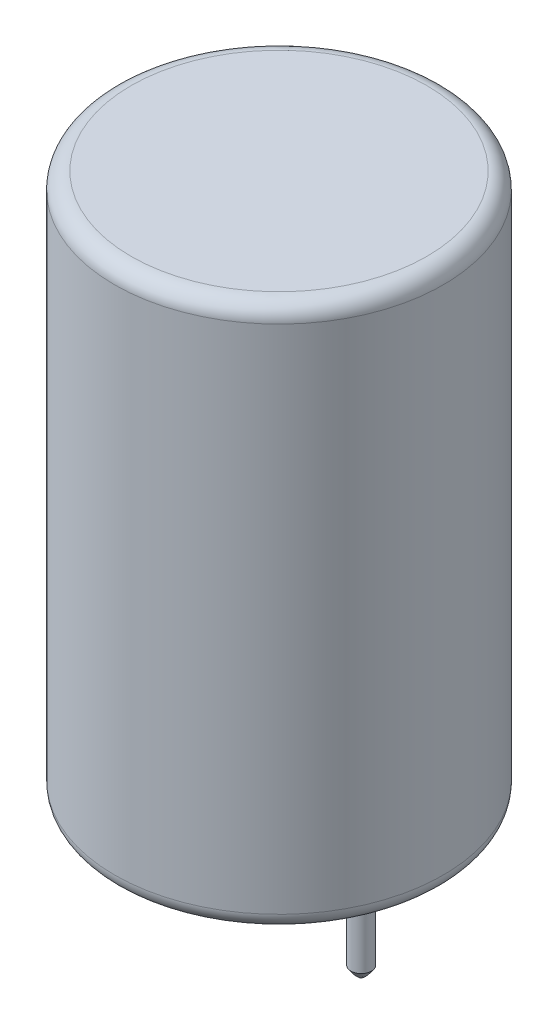
ISO-10303-21;
HEADER;
FILE_DESCRIPTION(('STEP AP214'),'2;1');
FILE_NAME('part.step','',(''),(''),'','','');
FILE_SCHEMA(('AUTOMOTIVE_DESIGN { 1 0 10303 214 1 1 1 1 }'));
ENDSEC;
DATA;
#1=APPLICATION_CONTEXT('core data for automotive mechanical design processes');
#2=APPLICATION_PROTOCOL_DEFINITION('international standard','automotive_design',2000,#1);
#3=PRODUCT_CONTEXT('',#1,'mechanical');
#4=PRODUCT('Part','Part','',(#3));
#5=PRODUCT_RELATED_PRODUCT_CATEGORY('part','',(#4));
#6=PRODUCT_DEFINITION_FORMATION('','',#4);
#7=PRODUCT_DEFINITION_CONTEXT('part definition',#1,'design');
#8=PRODUCT_DEFINITION('design','',#6,#7);
#9=PRODUCT_DEFINITION_SHAPE('','',#8);
#10=(LENGTH_UNIT() NAMED_UNIT(*) SI_UNIT(.MILLI.,.METRE.));
#11=(NAMED_UNIT(*) PLANE_ANGLE_UNIT() SI_UNIT($,.RADIAN.));
#12=(NAMED_UNIT(*) SI_UNIT($,.STERADIAN.) SOLID_ANGLE_UNIT());
#13=UNCERTAINTY_MEASURE_WITH_UNIT(LENGTH_MEASURE(1.E-05),#10,'distance_accuracy_value','');
#14=(GEOMETRIC_REPRESENTATION_CONTEXT(3) GLOBAL_UNCERTAINTY_ASSIGNED_CONTEXT((#13)) GLOBAL_UNIT_ASSIGNED_CONTEXT((#10,
#11,#12)) REPRESENTATION_CONTEXT('',''));
#15=CARTESIAN_POINT('',(0.,0.,0.));
#16=DIRECTION('',(0.,0.,1.));
#17=DIRECTION('',(1.,0.,0.));
#18=AXIS2_PLACEMENT_3D('',#15,#16,#17);
#19=CARTESIAN_POINT('',(-2.2121405764895,-2.97991995029477,-0.33841980886002));
#20=CARTESIAN_POINT('',(-2.2121405764895,-3.02540346747887,-0.284272771610083));
#21=CARTESIAN_POINT('',(-2.2121405764895,-3.06685307894785,-0.230125734360147));
#22=CARTESIAN_POINT('',(-2.2121405764895,-3.10557640983094,-0.175978697110203));
#23=CARTESIAN_POINT('',(-2.2121405764895,-3.1500061513419,-0.0947580309862556));
#24=CARTESIAN_POINT('',(-2.2121405764895,-3.1622970764374,-0.013537364862308));
#25=CARTESIAN_POINT('',(-2.2121405764895,-3.16229714390734,0.0135362640117029));
#26=CARTESIAN_POINT('',(-2.2121405764895,-3.15000657529725,0.0947571506337286));
#27=CARTESIAN_POINT('',(-2.2121405764895,-3.10557691698548,0.175978037255754));
#28=CARTESIAN_POINT('',(-2.2121405764895,-3.0668534380914,0.230125295003776));
#29=CARTESIAN_POINT('',(-2.2121405764895,-3.02540365225227,0.284272552751791));
#30=CARTESIAN_POINT('',(-2.2121405764895,-2.97991993261518,0.338419810499813));
#31=CARTESIAN_POINT('',(-2.26459795570898,-3.02165924121491,-0.33841980886002));
#32=CARTESIAN_POINT('',(-2.26459795570898,-3.0745635674044,-0.284272771610083));
#33=CARTESIAN_POINT('',(-2.26459795570898,-3.12337085532034,-0.230125734360147));
#34=CARTESIAN_POINT('',(-2.26459795570898,-3.1697603210029,-0.175978697110203));
#35=CARTESIAN_POINT('',(-2.26459795570898,-3.22338619591631,-0.0947580309862556));
#36=CARTESIAN_POINT('',(-2.26459795570898,-3.23824715056686,-0.013537364862308));
#37=CARTESIAN_POINT('',(-2.26459795570898,-3.23824723232579,0.0135362640117029));
#38=CARTESIAN_POINT('',(-2.26459795570898,-3.22338670563087,0.0947571506337286));
#39=CARTESIAN_POINT('',(-2.26459795570898,-3.169760919011,0.175978037255754));
#40=CARTESIAN_POINT('',(-2.26459795570898,-3.1233712549197,0.230125295003776));
#41=CARTESIAN_POINT('',(-2.26459795570898,-3.07456376417401,0.284272552751791));
#42=CARTESIAN_POINT('',(-2.26459795570898,-3.02165920898465,0.338419810499813));
#43=CARTESIAN_POINT('',(-2.31705533492845,-3.05962050891527,-0.33841980886002));
#44=CARTESIAN_POINT('',(-2.31705533492845,-3.11988138283403,-0.284272771610083));
#45=CARTESIAN_POINT('',(-2.31705533492845,-3.17595235045638,-0.230125734360147));
#46=CARTESIAN_POINT('',(-2.31705533492845,-3.23024582082638,-0.175978697110203));
#47=CARTESIAN_POINT('',(-2.31705533492845,-3.29342714202738,-0.0947580309862556));
#48=CARTESIAN_POINT('',(-2.31705533492845,-3.31095597473085,-0.013537364862308));
#49=CARTESIAN_POINT('',(-2.31705533492845,-3.31095606931464,0.0135362640117029));
#50=CARTESIAN_POINT('',(-2.31705533492845,-3.29342774476692,0.0947571506337286));
#51=CARTESIAN_POINT('',(-2.31705533492845,-3.23024651733103,0.175978037255754));
#52=CARTESIAN_POINT('',(-2.31705533492845,-3.17595278582146,0.230125295003776));
#53=CARTESIAN_POINT('',(-2.31705533492845,-3.11988159323046,0.284272552751791));
#54=CARTESIAN_POINT('',(-2.31705533492845,-3.05962046879173,0.338419810499813));
#55=CARTESIAN_POINT('',(-2.36951271414792,-3.0949938947793,-0.33841980886002));
#56=CARTESIAN_POINT('',(-2.36951271414792,-3.16294076609095,-0.284272771610083));
#57=CARTESIAN_POINT('',(-2.36951271414792,-3.2268867929645,-0.230125734360147));
#58=CARTESIAN_POINT('',(-2.36951271414792,-3.28998217660317,-0.175978697110203));
#59=CARTESIAN_POINT('',(-2.36951271414792,-3.36208997162529,-0.0947580309862556));
#60=CARTESIAN_POINT('',(-2.36951271414792,-3.38235482474886,-0.013537364862308));
#61=CARTESIAN_POINT('',(-2.36951271414792,-3.38235493804984,0.0135362640117029));
#62=CARTESIAN_POINT('',(-2.36951271414792,-3.36209065363447,0.0947571506337286));
#63=CARTESIAN_POINT('',(-2.36951271414792,-3.28998295810336,0.175978037255754));
#64=CARTESIAN_POINT('',(-2.36951271414792,-3.22688728678382,0.230125295003776));
#65=CARTESIAN_POINT('',(-2.36951271414792,-3.16294102691514,0.284272552751791));
#66=CARTESIAN_POINT('',(-2.36951271414792,-3.09499388917528,0.338419810499813));
#67=CARTESIAN_POINT('',(-2.44819889011382,-3.13534943067642,-0.33841980886002));
#68=CARTESIAN_POINT('',(-2.44819889011382,-3.21258030520541,-0.284272771610083));
#69=CARTESIAN_POINT('',(-2.44819889011382,-3.28623524985192,-0.230125734360147));
#70=CARTESIAN_POINT('',(-2.44819889011382,-3.35834904610403,-0.175978697110203));
#71=CARTESIAN_POINT('',(-2.44819889011382,-3.44743331913199,-0.0947580309862556));
#72=CARTESIAN_POINT('',(-2.44819889011382,-3.47285942689689,-0.013537364862308));
#73=CARTESIAN_POINT('',(-2.44819889011382,-3.47285956258608,0.0135362640117029));
#74=CARTESIAN_POINT('',(-2.44819889011382,-3.44743418546705,0.0947571506337286));
#75=CARTESIAN_POINT('',(-2.44819889011382,-3.3583499448534,0.175978037255754));
#76=CARTESIAN_POINT('',(-2.44819889011382,-3.28623584135529,0.230125295003776));
#77=CARTESIAN_POINT('',(-2.44819889011382,-3.212580623015,0.284272552751791));
#78=CARTESIAN_POINT('',(-2.44819889011382,-3.13534944212213,0.338419810499813));
#79=CARTESIAN_POINT('',(-2.52688506607971,-3.14646199167535,-0.33841980886002));
#80=CARTESIAN_POINT('',(-2.52688506607971,-3.22630050938786,-0.284272771610083));
#81=CARTESIAN_POINT('',(-2.52688506607971,-3.30269088020372,-0.230125734360147));
#82=CARTESIAN_POINT('',(-2.52688506607971,-3.37759495589457,-0.175978697110203));
#83=CARTESIAN_POINT('',(-2.52688506607971,-3.47184862515334,-0.0947580309862556));
#84=CARTESIAN_POINT('',(-2.52688506607971,-3.50108058388279,-0.013537364862308));
#85=CARTESIAN_POINT('',(-2.52688506607971,-3.50108075565038,0.0135362640117029));
#86=CARTESIAN_POINT('',(-2.52688506607971,-3.47184955971248,0.0947571506337286));
#87=CARTESIAN_POINT('',(-2.52688506607971,-3.37759588901666,0.175978037255754));
#88=CARTESIAN_POINT('',(-2.52688506607971,-3.30269150005831,0.230125295003776));
#89=CARTESIAN_POINT('',(-2.52688506607971,-3.2263008304482,0.284272552751791));
#90=CARTESIAN_POINT('',(-2.52688506607971,-3.14646198993273,0.338419810499813));
#91=CARTESIAN_POINT('',(-2.55311386282614,-3.14646208077881,-0.33841980886002));
#92=CARTESIAN_POINT('',(-2.55311386282614,-3.22630060320655,-0.284272771610083));
#93=CARTESIAN_POINT('',(-2.55311386282614,-3.30269095718495,-0.230125734360147));
#94=CARTESIAN_POINT('',(-2.55311386282614,-3.3775950683702,-0.175978697110203));
#95=CARTESIAN_POINT('',(-2.55311386282614,-3.4718487536044,-0.0947580309862556));
#96=CARTESIAN_POINT('',(-2.55311386282614,-3.50108075115408,-0.013537364862308));
#97=CARTESIAN_POINT('',(-2.55311386282614,-3.50108092297968,0.0135362640117029));
#98=CARTESIAN_POINT('',(-2.55311386282614,-3.47184968872334,0.0947571506337286));
#99=CARTESIAN_POINT('',(-2.55311386282614,-3.37759600219526,0.175978037255754));
#100=CARTESIAN_POINT('',(-2.55311386282614,-3.30269157683032,0.230125295003776));
#101=CARTESIAN_POINT('',(-2.55311386282614,-3.2263009246369,0.284272552751791));
#102=CARTESIAN_POINT('',(-2.55311386282614,-3.14646207869072,0.338419810499813));
#103=CARTESIAN_POINT('',(-2.63180025306541,-3.13534985663853,-0.33841980886002));
#104=CARTESIAN_POINT('',(-2.63180025306541,-3.2125807880125,-0.284272771610083));
#105=CARTESIAN_POINT('',(-2.63180025306541,-3.28623582642202,-0.230125734360147));
#106=CARTESIAN_POINT('',(-2.63180025306541,-3.35834968184776,-0.175978697110203));
#107=CARTESIAN_POINT('',(-2.63180025306541,-3.44743415670746,-0.0947580309862556));
#108=CARTESIAN_POINT('',(-2.63180025306541,-3.47286032980052,-0.013537364862308));
#109=CARTESIAN_POINT('',(-2.63180025306541,-3.4728604651394,0.0135362640117029));
#110=CARTESIAN_POINT('',(-2.63180025306541,-3.44743502526104,0.0947571506337286));
#111=CARTESIAN_POINT('',(-2.63180025306541,-3.35835059214529,0.175978037255754));
#112=CARTESIAN_POINT('',(-2.63180025306541,-3.28623641933485,0.230125295003776));
#113=CARTESIAN_POINT('',(-2.63180025306541,-3.21258110577831,0.284272552751791));
#114=CARTESIAN_POINT('',(-2.63180025306541,-3.13534986430462,0.338419810499813));
#115=CARTESIAN_POINT('',(-2.71048664330468,-3.09499430241201,-0.33841980886002));
#116=CARTESIAN_POINT('',(-2.71048664330468,-3.16294127483425,-0.284272771610083));
#117=CARTESIAN_POINT('',(-2.71048664330468,-3.22688739300875,-0.230125734360147));
#118=CARTESIAN_POINT('',(-2.71048664330468,-3.28998292405067,-0.175978697110203));
#119=CARTESIAN_POINT('',(-2.71048664330468,-3.36209084011595,-0.0947580309862556));
#120=CARTESIAN_POINT('',(-2.71048664330468,-3.38235571947481,-0.013537364862308));
#121=CARTESIAN_POINT('',(-2.71048664330468,-3.38235583214882,0.0135362640117029));
#122=CARTESIAN_POINT('',(-2.71048664330468,-3.3620915109207,0.0947571506337286));
#123=CARTESIAN_POINT('',(-2.71048664330468,-3.28998371558651,0.175978037255754));
#124=CARTESIAN_POINT('',(-2.71048664330468,-3.22688793603265,0.230125295003776));
#125=CARTESIAN_POINT('',(-2.71048664330468,-3.16294156659044,0.284272552751791));
#126=CARTESIAN_POINT('',(-2.71048664330468,-3.09499432467299,0.338419810499813));
#127=CARTESIAN_POINT('',(-2.76294423679752,-3.05962076531486,-0.33841980886002));
#128=CARTESIAN_POINT('',(-2.76294423679752,-3.11988171211155,-0.284272771610083));
#129=CARTESIAN_POINT('',(-2.76294423679752,-3.17595276530498,-0.230125734360147));
#130=CARTESIAN_POINT('',(-2.76294423679752,-3.23024633309219,-0.175978697110203));
#131=CARTESIAN_POINT('',(-2.76294423679752,-3.29342771444323,-0.0947580309862556));
#132=CARTESIAN_POINT('',(-2.76294423679752,-3.31095656458291,-0.013537364862308));
#133=CARTESIAN_POINT('',(-2.76294423679752,-3.31095665742237,0.0135362640117029));
#134=CARTESIAN_POINT('',(-2.76294423679752,-3.29342830602384,0.0947571506337286));
#135=CARTESIAN_POINT('',(-2.76294423679752,-3.23024698163856,0.175978037255754));
#136=CARTESIAN_POINT('',(-2.76294423679752,-3.17595322602541,0.230125295003776));
#137=CARTESIAN_POINT('',(-2.76294423679752,-3.1198819839571,0.284272552751791));
#138=CARTESIAN_POINT('',(-2.76294423679752,-3.05962081051975,0.338419810499813));
#139=CARTESIAN_POINT('',(-2.81540183029037,-3.02165937080222,-0.33841980886002));
#140=CARTESIAN_POINT('',(-2.81540183029037,-3.07456375276415,-0.284272771610083));
#141=CARTESIAN_POINT('',(-2.81540183029037,-3.12337109971785,-0.230125734360147));
#142=CARTESIAN_POINT('',(-2.81540183029037,-3.16976060622473,-0.175978697110203));
#143=CARTESIAN_POINT('',(-2.81540183029037,-3.22338649770977,-0.0947580309862556));
#144=CARTESIAN_POINT('',(-2.81540183029037,-3.23824745756087,-0.013537364862308));
#145=CARTESIAN_POINT('',(-2.81540183029037,-3.23824753900981,0.0135362640117029));
#146=CARTESIAN_POINT('',(-2.81540183029037,-3.22338699796589,0.0947571506337286));
#147=CARTESIAN_POINT('',(-2.81540183029037,-3.16976115781005,0.175978037255754));
#148=CARTESIAN_POINT('',(-2.81540183029037,-3.12337146866445,0.230125295003776));
#149=CARTESIAN_POINT('',(-2.81540183029037,-3.07456396815763,0.284272552751791));
#150=CARTESIAN_POINT('',(-2.81540183029037,-3.02165939706916,0.338419810499813));
#151=CARTESIAN_POINT('',(-2.86785942378321,-2.97991993437984,-0.33841980886002));
#152=CARTESIAN_POINT('',(-2.86785942378321,-3.02540348003199,-0.284272771610083));
#153=CARTESIAN_POINT('',(-2.86785942378321,-3.06685311978862,-0.230125734360147));
#154=CARTESIAN_POINT('',(-2.86785942378321,-3.10557644265557,-0.175978697110203));
#155=CARTESIAN_POINT('',(-2.86785942378321,-3.15000615606592,-0.0947580309862556));
#156=CARTESIAN_POINT('',(-2.86785942378321,-3.16229707612686,-0.013537364862308));
#157=CARTESIAN_POINT('',(-2.86785942378321,-3.16229714421264,0.0135362640117029));
#158=CARTESIAN_POINT('',(-2.86785942378321,-3.15000657285462,0.0947571506337286));
#159=CARTESIAN_POINT('',(-2.86785942378321,-3.10557689290419,0.175978037255754));
#160=CARTESIAN_POINT('',(-2.86785942378321,-3.06685340585381,0.230125295003776));
#161=CARTESIAN_POINT('',(-2.86785942378321,-3.02540363791797,0.284272552751791));
#162=CARTESIAN_POINT('',(-2.86785942378321,-2.97991993487969,0.338419810499813));
#163=B_SPLINE_SURFACE_WITH_KNOTS('',5,5,((#19,#20,#21,#22,#23,#24,#25,#26,#27,#28,#29,#30),(#31,
#32,#33,#34,#35,#36,#37,#38,#39,#40,#41,#42),(#43,#44,#45,#46,#47,#48,#49,#50,#51,#52,#53,#54),
(#55,#56,#57,#58,#59,#60,#61,#62,#63,#64,#65,#66),(#67,#68,#69,#70,#71,#72,#73,#74,#75,#76,#77,
#78),(#79,#80,#81,#82,#83,#84,#85,#86,#87,#88,#89,#90),(#91,#92,#93,#94,#95,#96,#97,#98,#99,
#100,#101,#102),(#103,#104,#105,#106,#107,#108,#109,#110,#111,#112,#113,#114),(#115,#116,#117,
#118,#119,#120,#121,#122,#123,#124,#125,#126),(#127,#128,#129,#130,#131,#132,#133,#134,#135,
#136,#137,#138),(#139,#140,#141,#142,#143,#144,#145,#146,#147,#148,#149,#150),(#151,#152,#153,
#154,#155,#156,#157,#158,#159,#160,#161,#162)),.UNSPECIFIED.,.F.,.F.,.F.,(6,3,3,6),(6,3,3,6),
(-0.327859422665936,-0.0655725265685716,0.0655714571635435,0.327859424627774),
(-0.338419808882282,-0.0676846226325865,0.0676835217374595,0.338419810477552),.UNSPECIFIED.);
#164=CARTESIAN_POINT('',(-2.53999999999999,-3.17511910564731,-0.317500000000001));
#165=CARTESIAN_POINT('',(-2.55718441968007,-3.175118839067,-0.317498847356079));
#166=CARTESIAN_POINT('',(-2.57438004879623,-3.17512562699577,-0.316100353873594));
#167=CARTESIAN_POINT('',(-2.60834577791041,-3.17511170251485,-0.310535431311729));
#168=CARTESIAN_POINT('',(-2.62511497184738,-3.17509093584544,-0.306363549035567));
#169=CARTESIAN_POINT('',(-2.65835205964256,-3.17507961059941,-0.295156643179936));
#170=CARTESIAN_POINT('',(-2.67478690251701,-3.17509017629955,-0.288023155841445));
#171=CARTESIAN_POINT('',(-2.70622578574919,-3.17512486630313,-0.271097905752989));
#172=CARTESIAN_POINT('',(-2.72122972166688,-3.17514899159538,-0.261305949165159));
#173=CARTESIAN_POINT('',(-2.74937989688664,-3.17517825563069,-0.239342755916825));
#174=CARTESIAN_POINT('',(-2.76252627420269,-3.17518339578504,-0.227171696180658));
#175=CARTESIAN_POINT('',(-2.78658977092269,-3.17517088740499,-0.200794583107967));
#176=CARTESIAN_POINT('',(-2.79750676489323,-3.17515323758875,-0.18658841534517));
#177=CARTESIAN_POINT('',(-2.81680046855974,-3.17511362762603,-0.156545349067934));
#178=CARTESIAN_POINT('',(-2.82517725630883,-3.17509166761202,-0.140708500679584));
#179=CARTESIAN_POINT('',(-2.83915314196634,-3.17508873415095,-0.107853333984569));
#180=CARTESIAN_POINT('',(-2.84475225767804,-3.17510776044118,-0.0908350232511944));
#181=CARTESIAN_POINT('',(-2.85301105495971,-3.17513452660616,-0.0561122111911549));
#182=CARTESIAN_POINT('',(-2.85567279501047,-3.17514227438599,-0.0384081994137605));
#183=CARTESIAN_POINT('',(-2.85799003083086,-3.17515159450327,-0.00277946569029197));
#184=CARTESIAN_POINT('',(-2.85764130816539,-3.17515315817071,0.0151455308043003));
#185=CARTESIAN_POINT('',(-2.85393872011126,-3.17513771550911,0.050669877937174));
#186=CARTESIAN_POINT('',(-2.85058692008867,-3.17512072194105,0.0682694439010596));
#187=CARTESIAN_POINT('',(-2.84097621364185,-3.17509547271063,0.102656076316709));
#188=CARTESIAN_POINT('',(-2.83471730751916,-3.17508721704737,0.11944314285275));
#189=CARTESIAN_POINT('',(-2.81946365054735,-3.17510338835353,0.15174171588663));
#190=CARTESIAN_POINT('',(-2.81046662942855,-3.17512784250118,0.167252150273176));
#191=CARTESIAN_POINT('',(-2.79001154219019,-3.17516542052518,0.196516283963486));
#192=CARTESIAN_POINT('',(-2.77855760301139,-3.17517856321831,0.210272868216443));
#193=CARTESIAN_POINT('',(-2.75348495144167,-3.17518108053032,0.235689607512293));
#194=CARTESIAN_POINT('',(-2.73986290533946,-3.17517041821191,0.247346474181774));
#195=CARTESIAN_POINT('',(-2.71087432920135,-3.17513425043868,0.26819101592461));
#196=CARTESIAN_POINT('',(-2.69551030595595,-3.17510876610061,0.277382176690267));
#197=CARTESIAN_POINT('',(-2.66343211685882,-3.17508344603061,0.293070385964144));
#198=CARTESIAN_POINT('',(-2.64671567130168,-3.17508365454746,0.299562767287329));
#199=CARTESIAN_POINT('',(-2.61245727273129,-3.17510053855604,0.3096351144573));
#200=CARTESIAN_POINT('',(-2.59491705645687,-3.17511718076512,0.313220940136494));
#201=CARTESIAN_POINT('',(-2.56486392005579,-3.17512320425512,0.316769995460422));
#202=CARTESIAN_POINT('',(-2.55243489475126,-3.17511930790735,0.317500834070273));
#203=CARTESIAN_POINT('',(-2.52281558031048,-3.17511882915381,0.317498847355458));
#204=CARTESIAN_POINT('',(-2.50561995120013,-3.17512560874395,0.316100353873327));
#205=CARTESIAN_POINT('',(-2.47165422209351,-3.17511168368534,0.31053543131204));
#206=CARTESIAN_POINT('',(-2.45488502815823,-3.17509092480865,0.306363549036508));
#207=CARTESIAN_POINT('',(-2.42164794029352,-3.17507960966223,0.295156643159366));
#208=CARTESIAN_POINT('',(-2.40521309735262,-3.17509017745994,0.288023155785386));
#209=CARTESIAN_POINT('',(-2.37377421400042,-3.17512486942245,0.271097905604061));
#210=CARTESIAN_POINT('',(-2.35877027802894,-3.17514899457591,0.261305948959231));
#211=CARTESIAN_POINT('',(-2.33062010273172,-3.17517825747841,0.239342755587671));
#212=CARTESIAN_POINT('',(-2.31747372539059,-3.17518339663882,0.227171695787081));
#213=CARTESIAN_POINT('',(-2.29341022863983,-3.1751708870448,0.200794582576169));
#214=CARTESIAN_POINT('',(-2.28249323466367,-3.17515323700856,0.18658841473952));
#215=CARTESIAN_POINT('',(-2.26319953103626,-3.17511362672408,0.156545348354527));
#216=CARTESIAN_POINT('',(-2.25482274332431,-3.17509166660832,0.14070849993714));
#217=CARTESIAN_POINT('',(-2.24084685774684,-3.17508873288866,0.107853333190292));
#218=CARTESIAN_POINT('',(-2.23524774207799,-3.17510775902207,0.0908350224341422));
#219=CARTESIAN_POINT('',(-2.22698894489176,-3.17513452593837,0.0561122103581172));
#220=CARTESIAN_POINT('',(-2.22432720488992,-3.17514227462561,0.0384081985883794));
#221=CARTESIAN_POINT('',(-2.22200996916296,-3.17515159491189,0.00277946488805744));
#222=CARTESIAN_POINT('',(-2.22235869187292,-3.17515315783863,-0.0151455315910326));
#223=CARTESIAN_POINT('',(-2.22606128001113,-3.17513771519151,-0.0506698786925612));
#224=CARTESIAN_POINT('',(-2.22941308007436,-3.17512072237761,-0.0682694446405007));
#225=CARTESIAN_POINT('',(-2.23902378659768,-3.17509547334162,-0.102656077017585));
#226=CARTESIAN_POINT('',(-2.24528269275623,-3.17508721711863,-0.119443143531012));
#227=CARTESIAN_POINT('',(-2.26053634979862,-3.17510338821907,-0.151741716523962));
#228=CARTESIAN_POINT('',(-2.26953337095371,-3.17512784272151,-0.167252150891439));
#229=CARTESIAN_POINT('',(-2.28998845826095,-3.17516542145513,-0.19651628453764));
#230=CARTESIAN_POINT('',(-2.30144239747235,-3.17517856450311,-0.210272868765563));
#231=CARTESIAN_POINT('',(-2.32651504910045,-3.17518108186516,-0.235689608003009));
#232=CARTESIAN_POINT('',(-2.34013709522786,-3.17517041924093,-0.247346474639671));
#233=CARTESIAN_POINT('',(-2.36912567140755,-3.175134248907,-0.268191016312561));
#234=CARTESIAN_POINT('',(-2.38448969466949,-3.1751087623168,-0.277382177040867));
#235=CARTESIAN_POINT('',(-2.4165678837792,-3.17508343549421,-0.293070386231357));
#236=CARTESIAN_POINT('',(-2.43328432933093,-3.17508363950671,-0.29956276751147));
#237=CARTESIAN_POINT('',(-2.46754272788423,-3.17510051414501,-0.309635114600249));
#238=CARTESIAN_POINT('',(-2.48508294414704,-3.1751171514889,-0.313220940241192));
#239=CARTESIAN_POINT('',(-2.51513608033448,-3.17512318531718,-0.316769995483153));
#240=CARTESIAN_POINT('',(-2.52756510543662,-3.17511929854868,-0.317500834069809));
#241=CARTESIAN_POINT('',(-2.53999999999999,-3.17511910564731,-0.317500000000001));
#242=B_SPLINE_CURVE_WITH_KNOTS('',3,(#164,#165,#166,#167,#168,#169,#170,#171,#172,#173,#174,
#175,#176,#177,#178,#179,#180,#181,#182,#183,#184,#185,#186,#187,#188,#189,#190,#191,#192,#193,
#194,#195,#196,#197,#198,#199,#200,#201,#202,#203,#204,#205,#206,#207,#208,#209,#210,#211,#212,
#213,#214,#215,#216,#217,#218,#219,#220,#221,#222,#223,#224,#225,#226,#227,#228,#229,#230,#231,
#232,#233,#234,#235,#236,#237,#238,#239,#240,#241),.UNSPECIFIED.,.T.,.F.,(4,2,2,2,2,2,2,2,2,2,2,
2,2,2,2,2,2,2,2,2,2,2,2,2,2,2,2,2,2,2,2,2,2,2,2,2,2,2,4),(0.,0.0515159946821393,
0.103133583870567,0.156625475769527,0.210121268988774,0.263613085453394,0.317107910737831,
0.370601092115848,0.424093930628914,0.477549258092358,0.531079502408778,0.584572959542534,
0.63806641112767,0.691604337456631,0.745053029451791,0.798584713288369,0.852040317415651,
0.905587985219509,0.959027426535814,0.996305145804007,1.04782114047337,1.09943872964142,
1.15293062177171,1.20642641521465,1.25991823186245,1.31341305733142,1.36690623873434,
1.42039907727147,1.47385440469211,1.52738464896525,1.58087810607417,1.63437155763402,
1.68790948396859,1.74135817596952,1.79488985979778,1.84834546392178,1.90189313166394,
1.95533257292091,1.99261029158267),.UNSPECIFIED.);
#243=CARTESIAN_POINT('',(-2.53999999999999,-3.17511910564731,-0.317500000000001));
#244=VERTEX_POINT('',#243);
#245=EDGE_CURVE('E142',#244,#244,#242,.T.);
#246=ORIENTED_EDGE('',*,*,#245,.F.);
#247=EDGE_LOOP('',(#246));
#248=FACE_BOUND('',#247,.T.);
#249=ADVANCED_FACE('F16',(#248),#163,.F.);
#250=CARTESIAN_POINT('',(2.21214057621679,-2.97991993919985,-0.338419808860138));
#251=CARTESIAN_POINT('',(2.26459795622331,-3.02165920967556,-0.338419808860138));
#252=CARTESIAN_POINT('',(2.31705533622983,-3.05962046582764,-0.338419808860138));
#253=CARTESIAN_POINT('',(2.36951271623634,-3.09499386306397,-0.338419808860138));
#254=CARTESIAN_POINT('',(2.44819889272693,-3.13534947642165,-0.338419808860138));
#255=CARTESIAN_POINT('',(2.52688506921753,-3.1464620197587,-0.338419808860138));
#256=CARTESIAN_POINT('',(2.5531138657016,-3.14646205262432,-0.338419808860138));
#257=CARTESIAN_POINT('',(2.63180025515382,-3.1353498110897,-0.338419808860138));
#258=CARTESIAN_POINT('',(2.71048664460604,-3.0949943346671,-0.338419808860138));
#259=CARTESIAN_POINT('',(2.76294423757419,-3.05962080877075,-0.338419808860138));
#260=CARTESIAN_POINT('',(2.81540183054234,-3.02165940253955,-0.338419808860138));
#261=CARTESIAN_POINT('',(2.86785942351049,-2.97991994546792,-0.338419808860138));
#262=CARTESIAN_POINT('',(2.21214057621679,-3.02540348165633,-0.284272771610194));
#263=CARTESIAN_POINT('',(2.26459795622331,-3.07456355853548,-0.284272771610194));
#264=CARTESIAN_POINT('',(2.31705533622983,-3.11988135220493,-0.284272771610194));
#265=CARTESIAN_POINT('',(2.36951271623634,-3.16294073855244,-0.284272771610194));
#266=CARTESIAN_POINT('',(2.44819889272693,-3.21258032080494,-0.284272771610194));
#267=CARTESIAN_POINT('',(2.52688506921753,-3.22630052775105,-0.284272771610194));
#268=CARTESIAN_POINT('',(2.5531138657016,-3.22630058475198,-0.284272771610194));
#269=CARTESIAN_POINT('',(2.63180025515382,-3.21258077265486,-0.284272771610194));
#270=CARTESIAN_POINT('',(2.71048664460604,-3.16294130303105,-0.284272771610194));
#271=CARTESIAN_POINT('',(2.76294423757419,-3.11988174318366,-0.284272771610194));
#272=CARTESIAN_POINT('',(2.81540183054234,-3.07456376187169,-0.284272771610194));
#273=CARTESIAN_POINT('',(2.86785942351049,-3.02540346585172,-0.284272771610194));
#274=CARTESIAN_POINT('',(2.21214057621679,-3.06685311827599,-0.230125734360244));
#275=CARTESIAN_POINT('',(2.26459795622331,-3.1233708730075,-0.230125734360244));
#276=CARTESIAN_POINT('',(2.31705533622983,-3.17595234266778,-0.230125734360244));
#277=CARTESIAN_POINT('',(2.36951271623634,-3.22688675989002,-0.230125734360244));
#278=CARTESIAN_POINT('',(2.44819889272693,-3.28623526381152,-0.230125734360244));
#279=CARTESIAN_POINT('',(2.52688506921753,-3.30269086908394,-0.230125734360244));
#280=CARTESIAN_POINT('',(2.5531138657016,-3.3026909681923,-0.230125734360244));
#281=CARTESIAN_POINT('',(2.63180025515382,-3.28623581275488,-0.230125734360244));
#282=CARTESIAN_POINT('',(2.71048664460604,-3.22688742686223,-0.230125734360244));
#283=CARTESIAN_POINT('',(2.76294423757419,-3.17595277361245,-0.230125734360244));
#284=CARTESIAN_POINT('',(2.81540183054234,-3.12337108230966,-0.230125734360244));
#285=CARTESIAN_POINT('',(2.86785942351049,-3.06685308046165,-0.230125734360244));
#286=CARTESIAN_POINT('',(2.21214057621679,-3.10557643942319,-0.175978697110293));
#287=CARTESIAN_POINT('',(2.26459795622331,-3.16976034591883,-0.175978697110293));
#288=CARTESIAN_POINT('',(2.31705533622983,-3.23024584391761,-0.175978697110293));
#289=CARTESIAN_POINT('',(2.36951271623634,-3.28998217805299,-0.175978697110293));
#290=CARTESIAN_POINT('',(2.44819889272693,-3.35834903949325,-0.175978697110293));
#291=CARTESIAN_POINT('',(2.52688506921753,-3.37759496068338,-0.175978697110293));
#292=CARTESIAN_POINT('',(2.5531138657016,-3.37759506345128,-0.175978697110293));
#293=CARTESIAN_POINT('',(2.63180025515382,-3.35834968879359,-0.175978697110293));
#294=CARTESIAN_POINT('',(2.71048664460604,-3.28998292351475,-0.175978697110293));
#295=CARTESIAN_POINT('',(2.76294423757419,-3.23024631060407,-0.175978697110293));
#296=CARTESIAN_POINT('',(2.81540183054234,-3.16976058162838,-0.175978697110293));
#297=CARTESIAN_POINT('',(2.86785942351049,-3.10557641306668,-0.175978697110293));
#298=CARTESIAN_POINT('',(2.21214057621679,-3.15000615471601,-0.0947580309863319));
#299=CARTESIAN_POINT('',(2.26459795622331,-3.22338620077526,-0.0947580309863319));
#300=CARTESIAN_POINT('',(2.31705533622983,-3.29342715005872,-0.0947580309863319));
#301=CARTESIAN_POINT('',(2.36951271623634,-3.36208997778567,-0.0947580309863319));
#302=CARTESIAN_POINT('',(2.44819889272693,-3.44743332316484,-0.0947580309863319));
#303=CARTESIAN_POINT('',(2.52688506921753,-3.47184862337557,-0.0947580309863319));
#304=CARTESIAN_POINT('',(2.5531138657016,-3.47184875521641,-0.0947580309863319));
#305=CARTESIAN_POINT('',(2.63180025515382,-3.44743415312159,-0.0947580309863319));
#306=CARTESIAN_POINT('',(2.71048664460604,-3.36209083501932,-0.0947580309863319));
#307=CARTESIAN_POINT('',(2.76294423757419,-3.29342770710341,-0.0947580309863319));
#308=CARTESIAN_POINT('',(2.81540183054234,-3.22338649321632,-0.0947580309863319));
#309=CARTESIAN_POINT('',(2.86785942351049,-3.15000615269334,-0.0947580309863319));
#310=CARTESIAN_POINT('',(2.21214057621679,-3.1622970757566,-0.0135373648623704));
#311=CARTESIAN_POINT('',(2.26459795622331,-3.23824715097728,-0.0135373648623704));
#312=CARTESIAN_POINT('',(2.31705533622983,-3.31095597624401,-0.0135373648623704));
#313=CARTESIAN_POINT('',(2.36951271623634,-3.38235482784417,-0.0135373648623704));
#314=CARTESIAN_POINT('',(2.44819889272693,-3.47285942909011,-0.0135373648623704));
#315=CARTESIAN_POINT('',(2.52688506921753,-3.50108058456571,-0.0135373648623704));
#316=CARTESIAN_POINT('',(2.5531138657016,-3.5010807502891,-0.0135373648623704));
#317=CARTESIAN_POINT('',(2.63180025515382,-3.47286032811216,-0.0135373648623704));
#318=CARTESIAN_POINT('',(2.71048664460604,-3.38235571747312,-0.0135373648623704));
#319=CARTESIAN_POINT('',(2.76294423757419,-3.31095656379426,-0.0135373648623704));
#320=CARTESIAN_POINT('',(2.81540183054234,-3.23824745752755,-0.0135373648623704));
#321=CARTESIAN_POINT('',(2.86785942351049,-3.16229707680801,-0.0135373648623704));
#322=CARTESIAN_POINT('',(2.21214057621679,-3.1622971438424,0.0135362640116474));
#323=CARTESIAN_POINT('',(2.26459795622331,-3.23824723242617,0.0135362640116474));
#324=CARTESIAN_POINT('',(2.31705533622983,-3.31095606908341,0.0135362640116474));
#325=CARTESIAN_POINT('',(2.36951271623634,-3.38235494051795,0.0135362640116474));
#326=CARTESIAN_POINT('',(2.44819889272693,-3.47285956442875,0.0135362640116474));
#327=CARTESIAN_POINT('',(2.52688506921753,-3.50108075639085,0.0135362640116474));
#328=CARTESIAN_POINT('',(2.5531138657016,-3.50108092205719,0.0135362640116474));
#329=CARTESIAN_POINT('',(2.63180025515382,-3.47286046380162,0.0135362640116474));
#330=CARTESIAN_POINT('',(2.71048664460604,-3.38235583077435,0.0135362640116474));
#331=CARTESIAN_POINT('',(2.76294423757419,-3.31095665837815,0.0135362640116474));
#332=CARTESIAN_POINT('',(2.81540183054234,-3.23824753928655,0.0135362640116474));
#333=CARTESIAN_POINT('',(2.86785942351049,-3.16229714427794,0.0135362640116474));
#334=CARTESIAN_POINT('',(2.21214057621679,-3.15000657150474,0.0947571506336869));
#335=CARTESIAN_POINT('',(2.26459795622331,-3.22338670103111,0.0947571506336869));
#336=CARTESIAN_POINT('',(2.31705533622983,-3.29342774163861,0.0947571506336869));
#337=CARTESIAN_POINT('',(2.36951271623634,-3.36209064858959,0.0947571506336869));
#338=CARTESIAN_POINT('',(2.44819889272693,-3.44743419171605,0.0947571506336869));
#339=CARTESIAN_POINT('',(2.52688506921753,-3.47184955849438,0.0947571506336869));
#340=CARTESIAN_POINT('',(2.5531138657016,-3.47184968977595,0.0947571506336869));
#341=CARTESIAN_POINT('',(2.63180025515382,-3.44743501945916,0.0947571506336869));
#342=CARTESIAN_POINT('',(2.71048664460604,-3.36209151702948,0.0947571506336869));
#343=CARTESIAN_POINT('',(2.76294423757419,-3.2934283098439,0.0947571506336869));
#344=CARTESIAN_POINT('',(2.81540183054234,-3.22338700293124,0.0947571506336869));
#345=CARTESIAN_POINT('',(2.86785942351049,-3.15000657664869,0.0947571506336869));
#346=CARTESIAN_POINT('',(2.21214057621679,-3.10557688967184,0.175978037255727));
#347=CARTESIAN_POINT('',(2.26459795622331,-3.16976089750377,0.175978037255727));
#348=CARTESIAN_POINT('',(2.31705533622983,-3.23024649246336,0.175978037255727));
#349=CARTESIAN_POINT('',(2.36951271623634,-3.28998296958716,0.175978037255727));
#350=CARTESIAN_POINT('',(2.44819889272693,-3.35834994979011,0.175978037255727));
#351=CARTESIAN_POINT('',(2.52688506921753,-3.37759589450846,0.175978037255727));
#352=CARTESIAN_POINT('',(2.5531138657016,-3.37759599657382,0.175978037255727));
#353=CARTESIAN_POINT('',(2.63180025515382,-3.35835058754413,0.175978037255727));
#354=CARTESIAN_POINT('',(2.71048664460604,-3.28998370501641,0.175978037255727));
#355=CARTESIAN_POINT('',(2.76294423757419,-3.23024700710955,0.175978037255727));
#356=CARTESIAN_POINT('',(2.81540183054234,-3.16976117963696,0.175978037255727));
#357=CARTESIAN_POINT('',(2.86785942351049,-3.10557692022129,0.175978037255727));
#358=CARTESIAN_POINT('',(2.21214057621679,-3.06685340434118,0.230125295003755));
#359=CARTESIAN_POINT('',(2.26459795622331,-3.12337124195379,0.230125295003755));
#360=CARTESIAN_POINT('',(2.31705533622983,-3.1759528033873,0.230125295003755));
#361=CARTESIAN_POINT('',(2.36951271623634,-3.22688730291344,0.230125295003755));
#362=CARTESIAN_POINT('',(2.44819889272693,-3.2862358567239,0.230125295003755));
#363=CARTESIAN_POINT('',(2.52688506921753,-3.30269148872935,0.230125295003755));
#364=CARTESIAN_POINT('',(2.5531138657016,-3.30269158804723,0.230125295003755));
#365=CARTESIAN_POINT('',(2.63180025515382,-3.28623640425933,0.230125295003755));
#366=CARTESIAN_POINT('',(2.71048664460604,-3.22688792068261,0.230125295003755));
#367=CARTESIAN_POINT('',(2.76294423757419,-3.17595320897784,0.230125295003755));
#368=CARTESIAN_POINT('',(2.81540183054234,-3.12337148190921,0.230125295003755));
#369=CARTESIAN_POINT('',(2.86785942351049,-3.06685343960526,0.230125295003755));
#370=CARTESIAN_POINT('',(2.21214057621679,-3.02540363954224,0.284272552751784));
#371=CARTESIAN_POINT('',(2.26459795622331,-3.07456377392868,0.284272552751784));
#372=CARTESIAN_POINT('',(2.31705533622983,-3.11988162405003,0.284272552751784));
#373=CARTESIAN_POINT('',(2.36951271623634,-3.16294103030859,0.284272552751784));
#374=CARTESIAN_POINT('',(2.44819889272693,-3.21258063857059,0.284272552751784));
#375=CARTESIAN_POINT('',(2.52688506921753,-3.22630084918163,0.284272552751784));
#376=CARTESIAN_POINT('',(2.5531138657016,-3.22630090581247,0.284272552751784));
#377=CARTESIAN_POINT('',(2.63180025515382,-3.21258109046499,0.284272552751784));
#378=CARTESIAN_POINT('',(2.71048664460604,-3.16294156385617,0.284272552751784));
#379=CARTESIAN_POINT('',(2.76294423757419,-3.11988195358014,0.284272552751784));
#380=CARTESIAN_POINT('',(2.81540183054234,-3.0745639586413,0.284272552751784));
#381=CARTESIAN_POINT('',(2.86785942351049,-3.02540365062507,0.284272552751784));
#382=CARTESIAN_POINT('',(2.21214057621679,-2.97991993969957,0.338419810499813));
#383=CARTESIAN_POINT('',(2.26459795622331,-3.02165923594229,0.338419810499813));
#384=CARTESIAN_POINT('',(2.31705533622983,-3.05962051103238,0.338419810499813));
#385=CARTESIAN_POINT('',(2.36951271623634,-3.09499388532531,0.338419810499813));
#386=CARTESIAN_POINT('',(2.44819889272693,-3.13534948408796,0.338419810499813));
#387=CARTESIAN_POINT('',(2.52688506921753,-3.14646201767089,0.338419810499813));
#388=CARTESIAN_POINT('',(2.5531138657016,-3.14646205088169,0.338419810499813));
#389=CARTESIAN_POINT('',(2.63180025515382,-3.13534982253549,0.338419810499813));
#390=CARTESIAN_POINT('',(2.71048664460604,-3.09499432906372,0.338419810499813));
#391=CARTESIAN_POINT('',(2.76294423757419,-3.05962076864704,0.338419810499813));
#392=CARTESIAN_POINT('',(2.81540183054234,-3.02165937030906,0.338419810499813));
#393=CARTESIAN_POINT('',(2.86785942351049,-2.97991992778814,0.338419810499813));
#394=B_SPLINE_SURFACE_WITH_KNOTS('',5,5,((#250,#251,#252,#253,#254,#255,#256,#257,#258,#259,
#260,#261),(#262,#263,#264,#265,#266,#267,#268,#269,#270,#271,#272,#273),(#274,#275,#276,#277,
#278,#279,#280,#281,#282,#283,#284,#285),(#286,#287,#288,#289,#290,#291,#292,#293,#294,#295,
#296,#297),(#298,#299,#300,#301,#302,#303,#304,#305,#306,#307,#308,#309),(#310,#311,#312,#313,
#314,#315,#316,#317,#318,#319,#320,#321),(#322,#323,#324,#325,#326,#327,#328,#329,#330,#331,
#332,#333),(#334,#335,#336,#337,#338,#339,#340,#341,#342,#343,#344,#345),(#346,#347,#348,#349,
#350,#351,#352,#353,#354,#355,#356,#357),(#358,#359,#360,#361,#362,#363,#364,#365,#366,#367,
#368,#369),(#370,#371,#372,#373,#374,#375,#376,#377,#378,#379,#380,#381),(#382,#383,#384,#385,
#386,#387,#388,#389,#390,#391,#392,#393)),.UNSPECIFIED.,.F.,.F.,.F.,(6,3,3,6),(6,3,3,6),
(-0.338419808882401,-0.0676846226326573,0.0676835217374125,0.338419810477552),
(-0.327859424627772,-0.0655725245951855,0.065571457825185,0.327859422665926),.UNSPECIFIED.);
#395=CARTESIAN_POINT('',(2.54,-3.17511910564768,-0.317500000000001));
#396=CARTESIAN_POINT('',(2.52281558004516,-3.17511883911609,-0.317498847355933));
#397=CARTESIAN_POINT('',(2.50561995065214,-3.17512562724819,-0.316100353828552));
#398=CARTESIAN_POINT('',(2.47165422100503,-3.17511170317783,-0.310535431088546));
#399=CARTESIAN_POINT('',(2.45488502681206,-3.17509093671564,-0.306363548678743));
#400=CARTESIAN_POINT('',(2.42164793881083,-3.17507961097235,-0.295156642559881));
#401=CARTESIAN_POINT('',(2.40521309597251,-3.1750901759341,-0.288023155134659));
#402=CARTESIAN_POINT('',(2.3737742128274,-3.17512486547316,-0.271097904880268));
#403=CARTESIAN_POINT('',(2.35877027696061,-3.17514899103934,-0.2613059482133));
#404=CARTESIAN_POINT('',(2.33062010186218,-3.17517825559647,-0.239342754821662));
#405=CARTESIAN_POINT('',(2.31747372461562,-3.17518339599871,-0.227171695022508));
#406=CARTESIAN_POINT('',(2.29341022804302,-3.17517088782204,-0.200794581837074));
#407=CARTESIAN_POINT('',(2.28249323415039,-3.17515323796126,-0.186588414024507));
#408=CARTESIAN_POINT('',(2.26319953064478,-3.17511362776446,-0.156545347660701));
#409=CARTESIAN_POINT('',(2.25482274297895,-3.17509166756091,-0.140708499235372));
#410=CARTESIAN_POINT('',(2.24084685749196,-3.17508873390446,-0.107853332481006));
#411=CARTESIAN_POINT('',(2.23524774186751,-3.17510776018885,-0.0908350217252639));
#412=CARTESIAN_POINT('',(2.2269889447612,-3.17513452645179,-0.0561122096332514));
#413=CARTESIAN_POINT('',(2.22432720479899,-3.17514227433532,-0.0384081978461403));
#414=CARTESIAN_POINT('',(2.2220099691556,-3.17515159453925,-0.00277946411813771));
#415=CARTESIAN_POINT('',(2.22235869190953,-3.17515315818947,0.0151455323712506));
#416=CARTESIAN_POINT('',(2.22606128013802,-3.17513771540146,0.0506698794813201));
#417=CARTESIAN_POINT('',(2.22941308024692,-3.17512072172428,0.0682694454275732));
#418=CARTESIAN_POINT('',(2.23902378686206,-3.17509547245156,0.102656077793874));
#419=CARTESIAN_POINT('',(2.24528269306675,-3.17508721685511,0.119443144298202));
#420=CARTESIAN_POINT('',(2.26053635019535,-3.17510338841578,0.151741717254237));
#421=CARTESIAN_POINT('',(2.26953337138879,-3.17512784275123,0.167252151594707));
#422=CARTESIAN_POINT('',(2.28998845876739,-3.17516542093578,0.196516285181499));
#423=CARTESIAN_POINT('',(2.30144239801181,-3.17517856360202,0.210272869377048));
#424=CARTESIAN_POINT('',(2.32651504970173,-3.17518108059095,0.235689608547821));
#425=CARTESIAN_POINT('',(2.3401370958585,-3.17517041797593,0.247346475149619));
#426=CARTESIAN_POINT('',(2.36912567209346,-3.17513424975782,0.268191016749384));
#427=CARTESIAN_POINT('',(2.38448969538114,-3.17510876527126,0.277382177439687));
#428=CARTESIAN_POINT('',(2.41656788455252,-3.17508344595706,0.293070386558664));
#429=CARTESIAN_POINT('',(2.43328433014187,-3.17508365538004,0.299562767801741));
#430=CARTESIAN_POINT('',(2.46754272876297,-3.17510053962002,0.309635114806937));
#431=CARTESIAN_POINT('',(2.48508294505588,-3.17511718115756,0.3132209404016));
#432=CARTESIAN_POINT('',(2.51513608096626,-3.17512320424463,0.316769995520621));
#433=CARTESIAN_POINT('',(2.52756510575955,-3.17511930794305,0.317500834070324));
#434=CARTESIAN_POINT('',(2.55718441996449,-3.17511882910532,0.317498847355321));
#435=CARTESIAN_POINT('',(2.57438004935187,-3.17512560849172,0.316100353828274));
#436=CARTESIAN_POINT('',(2.60834577899152,-3.1751116830206,0.310535431088733));
#437=CARTESIAN_POINT('',(2.62511497318274,-3.17509092393514,0.306363548679518));
#438=CARTESIAN_POINT('',(2.65835206125091,-3.17507960928864,0.295156642540077));
#439=CARTESIAN_POINT('',(2.67478690415322,-3.17509017782813,0.288023155080672));
#440=CARTESIAN_POINT('',(2.70622578741496,-3.17512487025768,0.271097904736087));
#441=CARTESIAN_POINT('',(2.72122972333458,-3.17514899513631,0.261305948013466));
#442=CARTESIAN_POINT('',(2.7493798985228,-3.17517825751431,0.239342754490822));
#443=CARTESIAN_POINT('',(2.76252627580585,-3.17518339642502,0.227171694615735));
#444=CARTESIAN_POINT('',(2.78658977242791,-3.17517088662477,0.200794581265634));
#445=CARTESIAN_POINT('',(2.79750676633342,-3.17515323663202,0.186588413364255));
#446=CARTESIAN_POINT('',(2.81680046980735,-3.17511362658186,0.156545346863553));
#447=CARTESIAN_POINT('',(2.82517725743677,-3.17509166665692,0.140708498395385));
#448=CARTESIAN_POINT('',(2.83915314284076,-3.17508873313644,0.107853331561511));
#449=CARTESIAN_POINT('',(2.84475225841865,-3.17510775927818,0.0908350207691153));
#450=CARTESIAN_POINT('',(2.85301105541668,-3.17513452609644,0.0561122086385846));
#451=CARTESIAN_POINT('',(2.8556727953217,-3.17514227467738,0.0384081968506753));
#452=CARTESIAN_POINT('',(2.85799003085261,-3.17515159487523,0.00277946313058812));
#453=CARTESIAN_POINT('',(2.85764130804342,-3.17515315781999,-0.0151455333500728));
#454=CARTESIAN_POINT('',(2.85393871970758,-3.17513771529787,-0.0506698804356515));
#455=CARTESIAN_POINT('',(2.85058691954639,-3.17512072259088,-0.0682694463661245));
#456=CARTESIAN_POINT('',(2.84097621283132,-3.17509547359806,-0.102656078691922));
#457=CARTESIAN_POINT('',(2.834717306579,-3.17508721731131,-0.119443145171525));
#458=CARTESIAN_POINT('',(2.8194636493552,-3.17510338816038,-0.151741718082591));
#459=CARTESIAN_POINT('',(2.81046662811235,-3.1751278424751,-0.167252152401929));
#460=CARTESIAN_POINT('',(2.79001154063896,-3.17516542104697,-0.196516285937446));
#461=CARTESIAN_POINT('',(2.77855760134913,-3.17517856412056,-0.210272870102836));
#462=CARTESIAN_POINT('',(2.75348494957509,-3.17518108180333,-0.235689609202846));
#463=CARTESIAN_POINT('',(2.73986290338018,-3.17517041947461,-0.247346475764578));
#464=CARTESIAN_POINT('',(2.71087432707903,-3.17513424958454,-0.268191017276992));
#465=CARTESIAN_POINT('',(2.69551030376308,-3.17510876314289,-0.277382177919753));
#466=CARTESIAN_POINT('',(2.6634321145628,-3.17508343556645,-0.293070386929653));
#467=CARTESIAN_POINT('',(2.64671566897473,-3.17508363867474,-0.299562768115111));
#468=CARTESIAN_POINT('',(2.61245727036568,-3.17510051308259,-0.309635115009659));
#469=CARTESIAN_POINT('',(2.5949170540835,-3.17511715109707,-0.313220940551204));
#470=CARTESIAN_POINT('',(2.56486391847134,-3.17512318532749,-0.31676999555347));
#471=CARTESIAN_POINT('',(2.55243489396646,-3.17511929851378,-0.317500834069862));
#472=CARTESIAN_POINT('',(2.54,-3.17511910564768,-0.317500000000001));
#473=B_SPLINE_CURVE_WITH_KNOTS('',3,(#395,#396,#397,#398,#399,#400,#401,#402,#403,#404,#405,
#406,#407,#408,#409,#410,#411,#412,#413,#414,#415,#416,#417,#418,#419,#420,#421,#422,#423,#424,
#425,#426,#427,#428,#429,#430,#431,#432,#433,#434,#435,#436,#437,#438,#439,#440,#441,#442,#443,
#444,#445,#446,#447,#448,#449,#450,#451,#452,#453,#454,#455,#456,#457,#458,#459,#460,#461,#462,
#463,#464,#465,#466,#467,#468,#469,#470,#471,#472),.UNSPECIFIED.,.T.,.F.,(4,2,2,2,2,2,2,2,2,2,2,
2,2,2,2,2,2,2,2,2,2,2,2,2,2,2,2,2,2,2,2,2,2,2,2,2,2,2,4),(0.,0.0515159955074552,
0.10313358552699,0.156625477429642,0.21012127065127,0.263613087091746,0.317107912352401,
0.370601093712516,0.424093932207543,0.477549259660695,0.531079503966691,0.584572961097281,
0.638066412678936,0.691604339001536,0.745053030989925,0.798584714819669,0.852040318939571,
0.90558798674693,0.959027428064396,0.996305145802049,1.0478211412974,1.09943873129626,
1.15293062342396,1.20642641686341,1.25991823353475,1.3134130590283,1.36690624044928,
1.42039907900441,1.47385440643539,1.52738465071902,1.58087810783109,1.63437155939442,
1.68790948573533,1.74135817774298,1.79488986157819,1.84834546570942,1.90189313345085,
1.95533257470397,1.99261029157743),.UNSPECIFIED.);
#474=CARTESIAN_POINT('',(2.54,-3.17511910564768,-0.317500000000001));
#475=VERTEX_POINT('',#474);
#476=EDGE_CURVE('E135',#475,#475,#473,.T.);
#477=ORIENTED_EDGE('',*,*,#476,.F.);
#478=EDGE_LOOP('',(#477));
#479=FACE_BOUND('',#478,.T.);
#480=ADVANCED_FACE('F18',(#479),#394,.F.);
#481=CARTESIAN_POINT('',(-2.54,-3.175,0.));
#482=DIRECTION('',(0.,1.,0.));
#483=DIRECTION('',(0.,0.,1.));
#484=AXIS2_PLACEMENT_3D('',#481,#482,#483);
#485=CYLINDRICAL_SURFACE('',#484,0.317500000000001);
#486=ORIENTED_EDGE('',*,*,#245,.T.);
#487=EDGE_LOOP('',(#486));
#488=FACE_BOUND('',#487,.T.);
#489=CARTESIAN_POINT('',(-2.54,0.,0.));
#490=DIRECTION('',(0.,1.,0.));
#491=DIRECTION('',(0.,0.,1.));
#492=AXIS2_PLACEMENT_3D('',#489,#490,#491);
#493=CIRCLE('',#492,0.317500000000001);
#494=CARTESIAN_POINT('',(-2.54,0.,0.317500000000001));
#495=VERTEX_POINT('',#494);
#496=EDGE_CURVE('E141',#495,#495,#493,.F.);
#497=ORIENTED_EDGE('',*,*,#496,.T.);
#498=EDGE_LOOP('',(#497));
#499=FACE_BOUND('',#498,.T.);
#500=ADVANCED_FACE('F131',(#488,#499),#485,.T.);
#501=CARTESIAN_POINT('',(2.54,-3.175,0.));
#502=DIRECTION('',(0.,1.,0.));
#503=DIRECTION('',(0.,0.,1.));
#504=AXIS2_PLACEMENT_3D('',#501,#502,#503);
#505=CYLINDRICAL_SURFACE('',#504,0.317500000000001);
#506=ORIENTED_EDGE('',*,*,#476,.T.);
#507=EDGE_LOOP('',(#506));
#508=FACE_BOUND('',#507,.T.);
#509=CARTESIAN_POINT('',(2.54,0.,0.));
#510=DIRECTION('',(0.,1.,0.));
#511=DIRECTION('',(0.,0.,1.));
#512=AXIS2_PLACEMENT_3D('',#509,#510,#511);
#513=CIRCLE('',#512,0.317500000000001);
#514=CARTESIAN_POINT('',(2.54,0.,0.317500000000001));
#515=VERTEX_POINT('',#514);
#516=EDGE_CURVE('E55',#515,#515,#513,.F.);
#517=ORIENTED_EDGE('',*,*,#516,.T.);
#518=EDGE_LOOP('',(#517));
#519=FACE_BOUND('',#518,.T.);
#520=ADVANCED_FACE('F126',(#508,#519),#505,.T.);
#521=CARTESIAN_POINT('',(0.,16.8148,0.));
#522=DIRECTION('',(0.,1.,0.));
#523=DIRECTION('',(0.,0.,1.));
#524=AXIS2_PLACEMENT_3D('',#521,#522,#523);
#525=PLANE('',#524);
#526=CARTESIAN_POINT('',(0.,16.8148,0.));
#527=DIRECTION('',(0.,-1.,0.));
#528=DIRECTION('',(0.,0.,-1.));
#529=AXIS2_PLACEMENT_3D('',#526,#527,#528);
#530=CIRCLE('',#529,4.572);
#531=CARTESIAN_POINT('',(0.,16.8148,-4.572));
#532=VERTEX_POINT('',#531);
#533=CARTESIAN_POINT('',(0.,16.8148,4.57200000000001));
#534=VERTEX_POINT('',#533);
#535=EDGE_CURVE('E53',#532,#534,#530,.T.);
#536=ORIENTED_EDGE('',*,*,#535,.F.);
#537=CARTESIAN_POINT('',(0.,16.8148,0.));
#538=DIRECTION('',(0.,-1.,0.));
#539=DIRECTION('',(0.,0.,1.));
#540=AXIS2_PLACEMENT_3D('',#537,#538,#539);
#541=CIRCLE('',#540,4.57200000000001);
#542=EDGE_CURVE('E48',#534,#532,#541,.T.);
#543=ORIENTED_EDGE('',*,*,#542,.F.);
#544=EDGE_LOOP('',(#536,#543));
#545=FACE_BOUND('',#544,.T.);
#546=ADVANCED_FACE('F52',(#545),#525,.T.);
#547=CARTESIAN_POINT('',(0.,0.,0.));
#548=DIRECTION('',(0.,1.,0.));
#549=DIRECTION('',(0.,0.,1.));
#550=AXIS2_PLACEMENT_3D('',#547,#548,#549);
#551=PLANE('',#550);
#552=ORIENTED_EDGE('',*,*,#516,.F.);
#553=EDGE_LOOP('',(#552));
#554=FACE_BOUND('',#553,.T.);
#555=CARTESIAN_POINT('',(0.,0.,0.));
#556=DIRECTION('',(0.,1.,0.));
#557=DIRECTION('',(0.,0.,1.));
#558=AXIS2_PLACEMENT_3D('',#555,#556,#557);
#559=CIRCLE('',#558,4.572);
#560=CARTESIAN_POINT('',(0.,0.,4.572));
#561=VERTEX_POINT('',#560);
#562=CARTESIAN_POINT('',(0.,0.,-4.572));
#563=VERTEX_POINT('',#562);
#564=EDGE_CURVE('E61',#561,#563,#559,.T.);
#565=ORIENTED_EDGE('',*,*,#564,.F.);
#566=CARTESIAN_POINT('',(0.,0.,0.));
#567=DIRECTION('',(0.,1.,0.));
#568=DIRECTION('',(0.,0.,-1.));
#569=AXIS2_PLACEMENT_3D('',#566,#567,#568);
#570=CIRCLE('',#569,4.572);
#571=EDGE_CURVE('E39',#563,#561,#570,.T.);
#572=ORIENTED_EDGE('',*,*,#571,.F.);
#573=EDGE_LOOP('',(#565,#572));
#574=FACE_BOUND('',#573,.T.);
#575=ORIENTED_EDGE('',*,*,#496,.F.);
#576=EDGE_LOOP('',(#575));
#577=FACE_BOUND('',#576,.T.);
#578=ADVANCED_FACE('F81',(#554,#574,#577),#551,.F.);
#579=CARTESIAN_POINT('',(0.,16.3068,0.));
#580=DIRECTION('',(0.,1.,0.));
#581=DIRECTION('',(0.,0.,1.));
#582=AXIS2_PLACEMENT_3D('',#579,#580,#581);
#583=TOROIDAL_SURFACE('',#582,4.572,0.508);
#584=ORIENTED_EDGE('',*,*,#542,.T.);
#585=ORIENTED_EDGE('',*,*,#535,.T.);
#586=EDGE_LOOP('',(#584,#585));
#587=FACE_BOUND('',#586,.T.);
#588=CARTESIAN_POINT('',(0.,16.3068,0.));
#589=DIRECTION('',(0.,-1.,0.));
#590=DIRECTION('',(0.,0.,-1.));
#591=AXIS2_PLACEMENT_3D('',#588,#589,#590);
#592=CIRCLE('',#591,5.08000000000001);
#593=CARTESIAN_POINT('',(0.,16.3068,-5.08000000000001));
#594=VERTEX_POINT('',#593);
#595=EDGE_CURVE('E31',#594,#594,#592,.T.);
#596=ORIENTED_EDGE('',*,*,#595,.F.);
#597=EDGE_LOOP('',(#596));
#598=FACE_BOUND('',#597,.T.);
#599=ADVANCED_FACE('F59',(#587,#598),#583,.T.);
#600=CARTESIAN_POINT('',(0.,0.508000000000002,0.));
#601=DIRECTION('',(0.,1.,0.));
#602=DIRECTION('',(0.,0.,1.));
#603=AXIS2_PLACEMENT_3D('',#600,#601,#602);
#604=TOROIDAL_SURFACE('',#603,4.572,0.508);
#605=CARTESIAN_POINT('',(0.,0.508000000000002,0.));
#606=DIRECTION('',(0.,-1.,0.));
#607=DIRECTION('',(0.,0.,-1.));
#608=AXIS2_PLACEMENT_3D('',#605,#606,#607);
#609=CIRCLE('',#608,5.08000000000001);
#610=CARTESIAN_POINT('',(0.,0.508000000000002,-5.08000000000001));
#611=VERTEX_POINT('',#610);
#612=EDGE_CURVE('E11',#611,#611,#609,.F.);
#613=ORIENTED_EDGE('',*,*,#612,.F.);
#614=EDGE_LOOP('',(#613));
#615=FACE_BOUND('',#614,.T.);
#616=ORIENTED_EDGE('',*,*,#564,.T.);
#617=ORIENTED_EDGE('',*,*,#571,.T.);
#618=EDGE_LOOP('',(#616,#617));
#619=FACE_BOUND('',#618,.T.);
#620=ADVANCED_FACE('F80',(#615,#619),#604,.T.);
#621=CARTESIAN_POINT('',(0.,16.8148,0.));
#622=DIRECTION('',(0.,-1.,0.));
#623=DIRECTION('',(0.,0.,-1.));
#624=AXIS2_PLACEMENT_3D('',#621,#622,#623);
#625=CYLINDRICAL_SURFACE('',#624,5.08000000000001);
#626=ORIENTED_EDGE('',*,*,#612,.T.);
#627=EDGE_LOOP('',(#626));
#628=FACE_BOUND('',#627,.T.);
#629=ORIENTED_EDGE('',*,*,#595,.T.);
#630=EDGE_LOOP('',(#629));
#631=FACE_BOUND('',#630,.T.);
#632=ADVANCED_FACE('F164',(#628,#631),#625,.T.);
#633=CLOSED_SHELL('',(#249,#480,#500,#520,#546,#578,#599,#620,#632));
#634=MANIFOLD_SOLID_BREP('B1',#633);
#635=ADVANCED_BREP_SHAPE_REPRESENTATION('',(#18,#634),#14);
#636=SHAPE_DEFINITION_REPRESENTATION(#9,#635);
ENDSEC;
END-ISO-10303-21;
